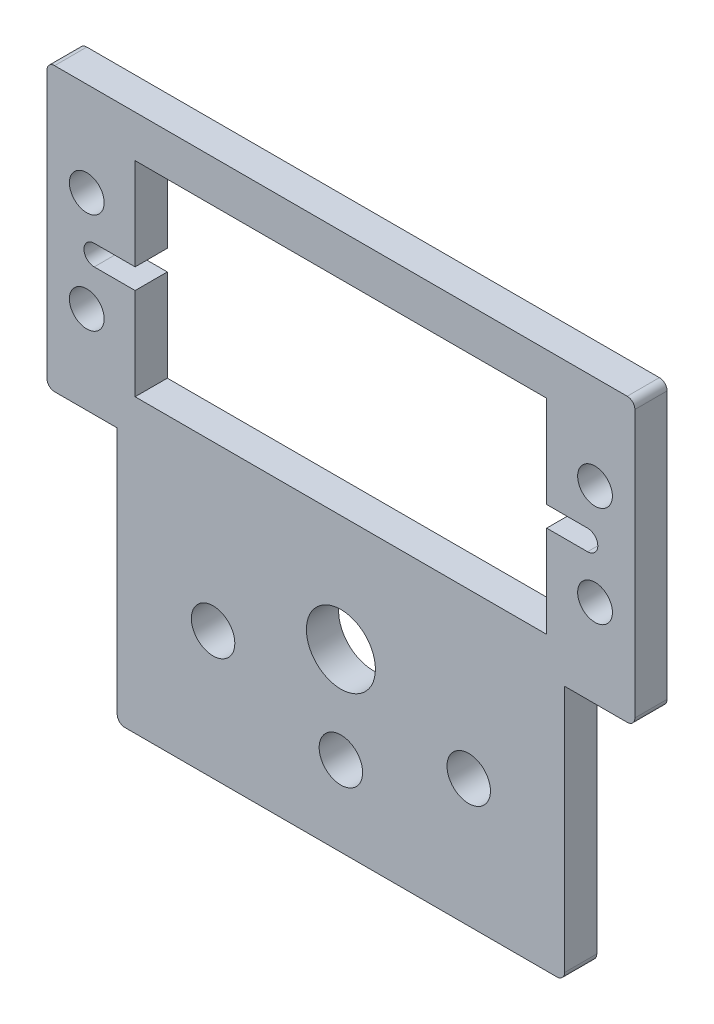
ISO-10303-21;
HEADER;
FILE_DESCRIPTION(('STEP AP214'),'2;1');
FILE_NAME('part.step','',(''),(''),'','','');
FILE_SCHEMA(('AUTOMOTIVE_DESIGN { 1 0 10303 214 1 1 1 1 }'));
ENDSEC;
DATA;
#1=APPLICATION_CONTEXT('core data for automotive mechanical design processes');
#2=APPLICATION_PROTOCOL_DEFINITION('international standard','automotive_design',2000,#1);
#3=PRODUCT_CONTEXT('',#1,'mechanical');
#4=PRODUCT('Part','Part','',(#3));
#5=PRODUCT_RELATED_PRODUCT_CATEGORY('part','',(#4));
#6=PRODUCT_DEFINITION_FORMATION('','',#4);
#7=PRODUCT_DEFINITION_CONTEXT('part definition',#1,'design');
#8=PRODUCT_DEFINITION('design','',#6,#7);
#9=PRODUCT_DEFINITION_SHAPE('','',#8);
#10=(LENGTH_UNIT() NAMED_UNIT(*) SI_UNIT(.MILLI.,.METRE.));
#11=(NAMED_UNIT(*) PLANE_ANGLE_UNIT() SI_UNIT($,.RADIAN.));
#12=(NAMED_UNIT(*) SI_UNIT($,.STERADIAN.) SOLID_ANGLE_UNIT());
#13=UNCERTAINTY_MEASURE_WITH_UNIT(LENGTH_MEASURE(1.E-05),#10,'distance_accuracy_value','');
#14=(GEOMETRIC_REPRESENTATION_CONTEXT(3) GLOBAL_UNCERTAINTY_ASSIGNED_CONTEXT((#13)) GLOBAL_UNIT_ASSIGNED_CONTEXT((#10,
#11,#12)) REPRESENTATION_CONTEXT('',''));
#15=CARTESIAN_POINT('',(0.,0.,0.));
#16=DIRECTION('',(0.,0.,1.));
#17=DIRECTION('',(1.,0.,0.));
#18=AXIS2_PLACEMENT_3D('',#15,#16,#17);
#19=CARTESIAN_POINT('',(1.778,49.2911153105269,3.2004));
#20=DIRECTION('',(1.,0.,0.));
#21=DIRECTION('',(0.,1.,0.));
#22=AXIS2_PLACEMENT_3D('',#19,#20,#21);
#23=PLANE('',#22);
#24=DIRECTION('',(0.,0.,1.));
#25=VECTOR('',#24,1.);
#26=CARTESIAN_POINT('',(1.77799999999999,40.1471153105269,-5.47132744404875));
#27=LINE('',#26,#25);
#28=CARTESIAN_POINT('',(1.77799999999999,40.1471153105269,0.));
#29=VERTEX_POINT('',#28);
#30=CARTESIAN_POINT('',(1.77799999999999,40.1471153105269,3.2004));
#31=VERTEX_POINT('',#30);
#32=EDGE_CURVE('E243',#29,#31,#27,.T.);
#33=ORIENTED_EDGE('',*,*,#32,.F.);
#34=DIRECTION('',(0.,-1.,0.));
#35=VECTOR('',#34,1.);
#36=CARTESIAN_POINT('',(1.778,49.2911153105269,0.));
#37=LINE('',#36,#35);
#38=CARTESIAN_POINT('',(1.778,49.2911153105269,0.));
#39=VERTEX_POINT('',#38);
#40=EDGE_CURVE('E230',#39,#29,#37,.T.);
#41=ORIENTED_EDGE('',*,*,#40,.F.);
#42=DIRECTION('',(0.,0.,-1.));
#43=VECTOR('',#42,1.);
#44=CARTESIAN_POINT('',(1.778,49.2911153105269,3.2004));
#45=LINE('',#44,#43);
#46=CARTESIAN_POINT('',(1.778,49.2911153105269,3.2004));
#47=VERTEX_POINT('',#46);
#48=EDGE_CURVE('E297',#47,#39,#45,.T.);
#49=ORIENTED_EDGE('',*,*,#48,.F.);
#50=DIRECTION('',(0.,-1.,0.));
#51=VECTOR('',#50,1.);
#52=CARTESIAN_POINT('',(1.778,49.2911153105269,3.2004));
#53=LINE('',#52,#51);
#54=EDGE_CURVE('E285',#47,#31,#53,.T.);
#55=ORIENTED_EDGE('',*,*,#54,.T.);
#56=EDGE_LOOP('',(#33,#41,#49,#55));
#57=FACE_BOUND('',#56,.T.);
#58=ADVANCED_FACE('F33',(#57),#23,.T.);
#59=CARTESIAN_POINT('',(42.672,49.2911153105269,3.2004));
#60=DIRECTION('',(-1.,0.,0.));
#61=DIRECTION('',(0.,-1.,0.));
#62=AXIS2_PLACEMENT_3D('',#59,#60,#61);
#63=PLANE('',#62);
#64=DIRECTION('',(0.,0.,1.));
#65=VECTOR('',#64,1.);
#66=CARTESIAN_POINT('',(42.672,38.1151153105269,-5.47132744404875));
#67=LINE('',#66,#65);
#68=CARTESIAN_POINT('',(42.672,38.1151153105269,0.));
#69=VERTEX_POINT('',#68);
#70=CARTESIAN_POINT('',(42.672,38.1151153105269,3.2004));
#71=VERTEX_POINT('',#70);
#72=EDGE_CURVE('E269',#69,#71,#67,.T.);
#73=ORIENTED_EDGE('',*,*,#72,.F.);
#74=DIRECTION('',(0.,1.,0.));
#75=VECTOR('',#74,1.);
#76=CARTESIAN_POINT('',(42.672,49.2911153105269,0.));
#77=LINE('',#76,#75);
#78=CARTESIAN_POINT('',(42.672,28.9711153105269,0.));
#79=VERTEX_POINT('',#78);
#80=EDGE_CURVE('E303',#79,#69,#77,.T.);
#81=ORIENTED_EDGE('',*,*,#80,.F.);
#82=DIRECTION('',(0.,0.,-1.));
#83=VECTOR('',#82,1.);
#84=CARTESIAN_POINT('',(42.672,28.9711153105269,3.2004));
#85=LINE('',#84,#83);
#86=CARTESIAN_POINT('',(42.672,28.9711153105269,3.2004));
#87=VERTEX_POINT('',#86);
#88=EDGE_CURVE('E313',#87,#79,#85,.T.);
#89=ORIENTED_EDGE('',*,*,#88,.F.);
#90=DIRECTION('',(0.,1.,0.));
#91=VECTOR('',#90,1.);
#92=CARTESIAN_POINT('',(42.672,49.2911153105269,3.2004));
#93=LINE('',#92,#91);
#94=EDGE_CURVE('E292',#87,#71,#93,.T.);
#95=ORIENTED_EDGE('',*,*,#94,.T.);
#96=EDGE_LOOP('',(#73,#81,#89,#95));
#97=FACE_BOUND('',#96,.T.);
#98=ADVANCED_FACE('F520',(#97),#63,.T.);
#99=CARTESIAN_POINT('',(0.,0.,3.2004));
#100=DIRECTION('',(0.,0.,-1.));
#101=DIRECTION('',(-1.,0.,0.));
#102=AXIS2_PLACEMENT_3D('',#99,#100,#101);
#103=PLANE('',#102);
#104=CARTESIAN_POINT('',(47.475,44.1311153105269,3.2004));
#105=DIRECTION('',(0.,0.,1.));
#106=DIRECTION('',(1.,0.,0.));
#107=AXIS2_PLACEMENT_3D('',#104,#105,#106);
#108=CIRCLE('',#107,1.72720000000001);
#109=CARTESIAN_POINT('',(49.2022,44.1311153105269,3.2004));
#110=VERTEX_POINT('',#109);
#111=EDGE_CURVE('E319',#110,#110,#108,.T.);
#112=ORIENTED_EDGE('',*,*,#111,.F.);
#113=EDGE_LOOP('',(#112));
#114=FACE_BOUND('',#113,.T.);
#115=CARTESIAN_POINT('',(-3.02500000000001,34.1311153105269,3.2004));
#116=DIRECTION('',(0.,0.,1.));
#117=DIRECTION('',(1.,0.,0.));
#118=AXIS2_PLACEMENT_3D('',#115,#116,#117);
#119=CIRCLE('',#118,1.7272);
#120=CARTESIAN_POINT('',(-1.2978,34.1311153105269,3.2004));
#121=VERTEX_POINT('',#120);
#122=EDGE_CURVE('E325',#121,#121,#119,.T.);
#123=ORIENTED_EDGE('',*,*,#122,.F.);
#124=EDGE_LOOP('',(#123));
#125=FACE_BOUND('',#124,.T.);
#126=CARTESIAN_POINT('',(-3.02500000000001,44.1311153105269,3.2004));
#127=DIRECTION('',(0.,0.,1.));
#128=DIRECTION('',(1.,0.,0.));
#129=AXIS2_PLACEMENT_3D('',#126,#127,#128);
#130=CIRCLE('',#129,1.72720000000001);
#131=CARTESIAN_POINT('',(-1.29780000000001,44.1311153105269,3.2004));
#132=VERTEX_POINT('',#131);
#133=EDGE_CURVE('E331',#132,#132,#130,.T.);
#134=ORIENTED_EDGE('',*,*,#133,.F.);
#135=EDGE_LOOP('',(#134));
#136=FACE_BOUND('',#135,.T.);
#137=CARTESIAN_POINT('',(47.475,34.1311153105269,3.2004));
#138=DIRECTION('',(0.,0.,1.));
#139=DIRECTION('',(1.,0.,0.));
#140=AXIS2_PLACEMENT_3D('',#137,#138,#139);
#141=CIRCLE('',#140,1.72720000000001);
#142=CARTESIAN_POINT('',(49.2022,34.1311153105269,3.2004));
#143=VERTEX_POINT('',#142);
#144=EDGE_CURVE('E337',#143,#143,#141,.T.);
#145=ORIENTED_EDGE('',*,*,#144,.F.);
#146=EDGE_LOOP('',(#145));
#147=FACE_BOUND('',#146,.T.);
#148=CARTESIAN_POINT('',(34.925,12.7,3.2004));
#149=DIRECTION('',(0.,0.,1.));
#150=DIRECTION('',(1.,0.,0.));
#151=AXIS2_PLACEMENT_3D('',#148,#149,#150);
#152=CIRCLE('',#151,2.159);
#153=CARTESIAN_POINT('',(37.084,12.7,3.2004));
#154=VERTEX_POINT('',#153);
#155=EDGE_CURVE('E343',#154,#154,#152,.T.);
#156=ORIENTED_EDGE('',*,*,#155,.F.);
#157=EDGE_LOOP('',(#156));
#158=FACE_BOUND('',#157,.T.);
#159=CARTESIAN_POINT('',(9.52499999999998,12.7,3.2004));
#160=DIRECTION('',(0.,0.,1.));
#161=DIRECTION('',(1.,0.,0.));
#162=AXIS2_PLACEMENT_3D('',#159,#160,#161);
#163=CIRCLE('',#162,2.159);
#164=CARTESIAN_POINT('',(11.684,12.7,3.2004));
#165=VERTEX_POINT('',#164);
#166=EDGE_CURVE('E349',#165,#165,#163,.T.);
#167=ORIENTED_EDGE('',*,*,#166,.F.);
#168=EDGE_LOOP('',(#167));
#169=FACE_BOUND('',#168,.T.);
#170=DIRECTION('',(1.,0.,0.));
#171=VECTOR('',#170,1.);
#172=CARTESIAN_POINT('',(0.,0.,3.2004));
#173=LINE('',#172,#171);
#174=CARTESIAN_POINT('',(0.762,0.,3.2004));
#175=VERTEX_POINT('',#174);
#176=CARTESIAN_POINT('',(43.688,0.,3.2004));
#177=VERTEX_POINT('',#176);
#178=EDGE_CURVE('E367',#175,#177,#173,.T.);
#179=ORIENTED_EDGE('',*,*,#178,.T.);
#180=CARTESIAN_POINT('',(43.688,0.762000000000003,3.2004));
#181=DIRECTION('',(0.,0.,-1.));
#182=DIRECTION('',(-1.,0.,0.));
#183=AXIS2_PLACEMENT_3D('',#180,#181,#182);
#184=CIRCLE('',#183,0.762);
#185=CARTESIAN_POINT('',(44.45,0.762000000000004,3.2004));
#186=VERTEX_POINT('',#185);
#187=EDGE_CURVE('E430',#177,#186,#184,.F.);
#188=ORIENTED_EDGE('',*,*,#187,.T.);
#189=DIRECTION('',(0.,1.,0.));
#190=VECTOR('',#189,1.);
#191=CARTESIAN_POINT('',(44.45,0.,3.2004));
#192=LINE('',#191,#190);
#193=CARTESIAN_POINT('',(44.4499999999999,25.4,3.2004));
#194=VERTEX_POINT('',#193);
#195=EDGE_CURVE('E370',#186,#194,#192,.T.);
#196=ORIENTED_EDGE('',*,*,#195,.T.);
#197=DIRECTION('',(1.,0.,0.));
#198=VECTOR('',#197,1.);
#199=CARTESIAN_POINT('',(44.4499999999999,25.4,3.2004));
#200=LINE('',#199,#198);
#201=CARTESIAN_POINT('',(50.673,25.4,3.2004));
#202=VERTEX_POINT('',#201);
#203=EDGE_CURVE('E372',#194,#202,#200,.T.);
#204=ORIENTED_EDGE('',*,*,#203,.T.);
#205=CARTESIAN_POINT('',(50.673,26.162,3.2004));
#206=DIRECTION('',(0.,0.,-1.));
#207=DIRECTION('',(-1.,0.,0.));
#208=AXIS2_PLACEMENT_3D('',#205,#206,#207);
#209=CIRCLE('',#208,0.762);
#210=CARTESIAN_POINT('',(51.435,26.162,3.2004));
#211=VERTEX_POINT('',#210);
#212=EDGE_CURVE('E55',#202,#211,#209,.F.);
#213=ORIENTED_EDGE('',*,*,#212,.T.);
#214=DIRECTION('',(0.,1.,0.));
#215=VECTOR('',#214,1.);
#216=CARTESIAN_POINT('',(51.4349999999999,53.4646590224651,3.2004));
#217=LINE('',#216,#215);
#218=CARTESIAN_POINT('',(51.4349999999999,52.7026590224651,3.2004));
#219=VERTEX_POINT('',#218);
#220=EDGE_CURVE('E374',#211,#219,#217,.T.);
#221=ORIENTED_EDGE('',*,*,#220,.T.);
#222=CARTESIAN_POINT('',(50.6729999999999,52.7026590224651,3.2004));
#223=DIRECTION('',(0.,0.,-1.));
#224=DIRECTION('',(-1.,0.,0.));
#225=AXIS2_PLACEMENT_3D('',#222,#223,#224);
#226=CIRCLE('',#225,0.762);
#227=CARTESIAN_POINT('',(50.6729999999999,53.4646590224651,3.2004));
#228=VERTEX_POINT('',#227);
#229=EDGE_CURVE('E427',#219,#228,#226,.F.);
#230=ORIENTED_EDGE('',*,*,#229,.T.);
#231=DIRECTION('',(-1.,0.,0.));
#232=VECTOR('',#231,1.);
#233=CARTESIAN_POINT('',(-6.98500000000005,53.464659022465,3.2004));
#234=LINE('',#233,#232);
#235=CARTESIAN_POINT('',(-6.22300000000006,53.464659022465,3.2004));
#236=VERTEX_POINT('',#235);
#237=EDGE_CURVE('E355',#228,#236,#234,.T.);
#238=ORIENTED_EDGE('',*,*,#237,.T.);
#239=CARTESIAN_POINT('',(-6.22300000000005,52.702659022465,3.2004));
#240=DIRECTION('',(0.,0.,-1.));
#241=DIRECTION('',(-1.,0.,0.));
#242=AXIS2_PLACEMENT_3D('',#239,#240,#241);
#243=CIRCLE('',#242,0.762);
#244=CARTESIAN_POINT('',(-6.98500000000005,52.702659022465,3.2004));
#245=VERTEX_POINT('',#244);
#246=EDGE_CURVE('E421',#236,#245,#243,.F.);
#247=ORIENTED_EDGE('',*,*,#246,.T.);
#248=DIRECTION('',(0.,-1.,0.));
#249=VECTOR('',#248,1.);
#250=CARTESIAN_POINT('',(-6.98500000000006,25.4,3.2004));
#251=LINE('',#250,#249);
#252=CARTESIAN_POINT('',(-6.98500000000006,26.162,3.2004));
#253=VERTEX_POINT('',#252);
#254=EDGE_CURVE('E358',#245,#253,#251,.T.);
#255=ORIENTED_EDGE('',*,*,#254,.T.);
#256=CARTESIAN_POINT('',(-6.22300000000006,26.162,3.2004));
#257=DIRECTION('',(0.,0.,-1.));
#258=DIRECTION('',(-1.,0.,0.));
#259=AXIS2_PLACEMENT_3D('',#256,#257,#258);
#260=CIRCLE('',#259,0.762);
#261=CARTESIAN_POINT('',(-6.22300000000006,25.4,3.2004));
#262=VERTEX_POINT('',#261);
#263=EDGE_CURVE('E423',#253,#262,#260,.F.);
#264=ORIENTED_EDGE('',*,*,#263,.T.);
#265=DIRECTION('',(1.,0.,0.));
#266=VECTOR('',#265,1.);
#267=CARTESIAN_POINT('',(0.,25.4,3.2004));
#268=LINE('',#267,#266);
#269=CARTESIAN_POINT('',(0.,25.4,3.2004));
#270=VERTEX_POINT('',#269);
#271=EDGE_CURVE('E362',#262,#270,#268,.T.);
#272=ORIENTED_EDGE('',*,*,#271,.T.);
#273=DIRECTION('',(0.,-1.,0.));
#274=VECTOR('',#273,1.);
#275=CARTESIAN_POINT('',(0.,0.,3.2004));
#276=LINE('',#275,#274);
#277=CARTESIAN_POINT('',(0.,0.762,3.2004));
#278=VERTEX_POINT('',#277);
#279=EDGE_CURVE('E364',#270,#278,#276,.T.);
#280=ORIENTED_EDGE('',*,*,#279,.T.);
#281=CARTESIAN_POINT('',(0.762,0.762,3.2004));
#282=DIRECTION('',(0.,0.,-1.));
#283=DIRECTION('',(-1.,0.,0.));
#284=AXIS2_PLACEMENT_3D('',#281,#282,#283);
#285=CIRCLE('',#284,0.762);
#286=EDGE_CURVE('E425',#278,#175,#285,.F.);
#287=ORIENTED_EDGE('',*,*,#286,.T.);
#288=EDGE_LOOP('',(#179,#188,#196,#204,#213,#221,#230,#238,#247,#255,#264,#272,#280,#287));
#289=FACE_BOUND('',#288,.T.);
#290=CARTESIAN_POINT('',(-2.28600000000005,39.1311153105269,3.2004));
#291=DIRECTION('',(0.,0.,1.));
#292=DIRECTION('',(1.,0.,0.));
#293=AXIS2_PLACEMENT_3D('',#290,#291,#292);
#294=CIRCLE('',#293,1.01600000000003);
#295=CARTESIAN_POINT('',(-2.28600000000001,40.1471153105269,3.2004));
#296=VERTEX_POINT('',#295);
#297=CARTESIAN_POINT('',(-2.286,38.1151153105269,3.2004));
#298=VERTEX_POINT('',#297);
#299=EDGE_CURVE('E233',#296,#298,#294,.T.);
#300=ORIENTED_EDGE('',*,*,#299,.F.);
#301=DIRECTION('',(-1.,0.,0.));
#302=VECTOR('',#301,1.);
#303=CARTESIAN_POINT('',(-2.28600000000001,40.1471153105269,3.2004));
#304=LINE('',#303,#302);
#305=EDGE_CURVE('E223',#31,#296,#304,.T.);
#306=ORIENTED_EDGE('',*,*,#305,.F.);
#307=ORIENTED_EDGE('',*,*,#54,.F.);
#308=DIRECTION('',(-1.,0.,0.));
#309=VECTOR('',#308,1.);
#310=CARTESIAN_POINT('',(1.778,49.2911153105269,3.2004));
#311=LINE('',#310,#309);
#312=CARTESIAN_POINT('',(42.672,49.2911153105269,3.2004));
#313=VERTEX_POINT('',#312);
#314=EDGE_CURVE('E295',#313,#47,#311,.T.);
#315=ORIENTED_EDGE('',*,*,#314,.F.);
#316=CARTESIAN_POINT('',(42.672,40.1471153105269,3.2004));
#317=VERTEX_POINT('',#316);
#318=EDGE_CURVE('E291',#317,#313,#93,.T.);
#319=ORIENTED_EDGE('',*,*,#318,.F.);
#320=DIRECTION('',(-1.,0.,0.));
#321=VECTOR('',#320,1.);
#322=CARTESIAN_POINT('',(42.672,40.1471153105269,3.2004));
#323=LINE('',#322,#321);
#324=CARTESIAN_POINT('',(46.736,40.1471153105269,3.2004));
#325=VERTEX_POINT('',#324);
#326=EDGE_CURVE('E247',#325,#317,#323,.T.);
#327=ORIENTED_EDGE('',*,*,#326,.F.);
#328=CARTESIAN_POINT('',(46.736,39.1311153105269,3.2004));
#329=DIRECTION('',(0.,0.,1.));
#330=DIRECTION('',(-1.,0.,0.));
#331=AXIS2_PLACEMENT_3D('',#328,#329,#330);
#332=CIRCLE('',#331,1.016);
#333=CARTESIAN_POINT('',(46.736,38.1151153105269,3.2004));
#334=VERTEX_POINT('',#333);
#335=EDGE_CURVE('E250',#334,#325,#332,.T.);
#336=ORIENTED_EDGE('',*,*,#335,.F.);
#337=DIRECTION('',(1.,0.,0.));
#338=VECTOR('',#337,1.);
#339=CARTESIAN_POINT('',(42.672,38.1151153105269,3.2004));
#340=LINE('',#339,#338);
#341=EDGE_CURVE('E253',#71,#334,#340,.T.);
#342=ORIENTED_EDGE('',*,*,#341,.F.);
#343=ORIENTED_EDGE('',*,*,#94,.F.);
#344=DIRECTION('',(1.,0.,0.));
#345=VECTOR('',#344,1.);
#346=CARTESIAN_POINT('',(1.77799999999996,28.9711153105269,3.2004));
#347=LINE('',#346,#345);
#348=CARTESIAN_POINT('',(1.77799999999996,28.9711153105269,3.2004));
#349=VERTEX_POINT('',#348);
#350=EDGE_CURVE('E288',#349,#87,#347,.T.);
#351=ORIENTED_EDGE('',*,*,#350,.F.);
#352=CARTESIAN_POINT('',(1.77799999999998,38.1151153105269,3.2004));
#353=VERTEX_POINT('',#352);
#354=EDGE_CURVE('E289',#353,#349,#53,.T.);
#355=ORIENTED_EDGE('',*,*,#354,.F.);
#356=DIRECTION('',(1.,0.,0.));
#357=VECTOR('',#356,1.);
#358=CARTESIAN_POINT('',(-2.286,38.1151153105269,3.2004));
#359=LINE('',#358,#357);
#360=EDGE_CURVE('E231',#298,#353,#359,.T.);
#361=ORIENTED_EDGE('',*,*,#360,.F.);
#362=EDGE_LOOP('',(#300,#306,#307,#315,#319,#327,#336,#342,#343,#351,#355,#361));
#363=FACE_BOUND('',#362,.T.);
#364=CARTESIAN_POINT('',(22.225,17.4625,3.2004));
#365=DIRECTION('',(0.,0.,1.));
#366=DIRECTION('',(1.,0.,0.));
#367=AXIS2_PLACEMENT_3D('',#364,#365,#366);
#368=CIRCLE('',#367,3.429);
#369=CARTESIAN_POINT('',(25.654,17.4625,3.2004));
#370=VERTEX_POINT('',#369);
#371=EDGE_CURVE('E279',#370,#370,#368,.T.);
#372=ORIENTED_EDGE('',*,*,#371,.F.);
#373=EDGE_LOOP('',(#372));
#374=FACE_BOUND('',#373,.T.);
#375=CARTESIAN_POINT('',(22.225,7.93750000000001,3.2004));
#376=DIRECTION('',(0.,0.,1.));
#377=DIRECTION('',(1.,0.,0.));
#378=AXIS2_PLACEMENT_3D('',#375,#376,#377);
#379=CIRCLE('',#378,2.159);
#380=CARTESIAN_POINT('',(24.384,7.93750000000001,3.2004));
#381=VERTEX_POINT('',#380);
#382=EDGE_CURVE('E273',#381,#381,#379,.T.);
#383=ORIENTED_EDGE('',*,*,#382,.F.);
#384=EDGE_LOOP('',(#383));
#385=FACE_BOUND('',#384,.T.);
#386=ADVANCED_FACE('F471',(#114,#125,#136,#147,#158,#169,#289,#363,#374,#385),#103,.F.);
#387=CARTESIAN_POINT('',(0.,0.,0.));
#388=DIRECTION('',(0.,0.,-1.));
#389=DIRECTION('',(-1.,0.,0.));
#390=AXIS2_PLACEMENT_3D('',#387,#388,#389);
#391=PLANE('',#390);
#392=DIRECTION('',(-1.,0.,0.));
#393=VECTOR('',#392,1.);
#394=CARTESIAN_POINT('',(-2.28600000000001,40.1471153105269,0.));
#395=LINE('',#394,#393);
#396=CARTESIAN_POINT('',(-2.28600000000001,40.1471153105269,0.));
#397=VERTEX_POINT('',#396);
#398=EDGE_CURVE('E220',#29,#397,#395,.T.);
#399=ORIENTED_EDGE('',*,*,#398,.T.);
#400=CARTESIAN_POINT('',(-2.28600000000005,39.1311153105269,0.));
#401=DIRECTION('',(0.,0.,-1.));
#402=DIRECTION('',(-1.,0.,0.));
#403=AXIS2_PLACEMENT_3D('',#400,#401,#402);
#404=CIRCLE('',#403,1.01600000000003);
#405=CARTESIAN_POINT('',(-2.286,38.1151153105269,0.));
#406=VERTEX_POINT('',#405);
#407=EDGE_CURVE('E207',#397,#406,#404,.F.);
#408=ORIENTED_EDGE('',*,*,#407,.T.);
#409=DIRECTION('',(1.,0.,0.));
#410=VECTOR('',#409,1.);
#411=CARTESIAN_POINT('',(-2.286,38.1151153105269,0.));
#412=LINE('',#411,#410);
#413=CARTESIAN_POINT('',(1.778,38.1151153105269,0.));
#414=VERTEX_POINT('',#413);
#415=EDGE_CURVE('E238',#406,#414,#412,.T.);
#416=ORIENTED_EDGE('',*,*,#415,.T.);
#417=CARTESIAN_POINT('',(1.77799999999996,28.9711153105269,0.));
#418=VERTEX_POINT('',#417);
#419=EDGE_CURVE('E282',#414,#418,#37,.T.);
#420=ORIENTED_EDGE('',*,*,#419,.T.);
#421=DIRECTION('',(1.,0.,0.));
#422=VECTOR('',#421,1.);
#423=CARTESIAN_POINT('',(1.77799999999996,28.9711153105269,0.));
#424=LINE('',#423,#422);
#425=EDGE_CURVE('E299',#418,#79,#424,.T.);
#426=ORIENTED_EDGE('',*,*,#425,.T.);
#427=ORIENTED_EDGE('',*,*,#80,.T.);
#428=DIRECTION('',(1.,0.,0.));
#429=VECTOR('',#428,1.);
#430=CARTESIAN_POINT('',(42.672,38.1151153105269,0.));
#431=LINE('',#430,#429);
#432=CARTESIAN_POINT('',(46.736,38.1151153105269,0.));
#433=VERTEX_POINT('',#432);
#434=EDGE_CURVE('E249',#69,#433,#431,.T.);
#435=ORIENTED_EDGE('',*,*,#434,.T.);
#436=CARTESIAN_POINT('',(46.736,39.1311153105269,0.));
#437=DIRECTION('',(0.,0.,-1.));
#438=DIRECTION('',(-1.,0.,0.));
#439=AXIS2_PLACEMENT_3D('',#436,#437,#438);
#440=CIRCLE('',#439,1.016);
#441=CARTESIAN_POINT('',(46.736,40.1471153105269,0.));
#442=VERTEX_POINT('',#441);
#443=EDGE_CURVE('E264',#433,#442,#440,.F.);
#444=ORIENTED_EDGE('',*,*,#443,.T.);
#445=DIRECTION('',(-1.,0.,0.));
#446=VECTOR('',#445,1.);
#447=CARTESIAN_POINT('',(42.672,40.1471153105269,0.));
#448=LINE('',#447,#446);
#449=CARTESIAN_POINT('',(42.672,40.1471153105269,0.));
#450=VERTEX_POINT('',#449);
#451=EDGE_CURVE('E259',#442,#450,#448,.T.);
#452=ORIENTED_EDGE('',*,*,#451,.T.);
#453=CARTESIAN_POINT('',(42.672,49.2911153105269,0.));
#454=VERTEX_POINT('',#453);
#455=EDGE_CURVE('E302',#450,#454,#77,.T.);
#456=ORIENTED_EDGE('',*,*,#455,.T.);
#457=DIRECTION('',(-1.,0.,0.));
#458=VECTOR('',#457,1.);
#459=CARTESIAN_POINT('',(1.778,49.2911153105269,0.));
#460=LINE('',#459,#458);
#461=EDGE_CURVE('E306',#454,#39,#460,.T.);
#462=ORIENTED_EDGE('',*,*,#461,.T.);
#463=ORIENTED_EDGE('',*,*,#40,.T.);
#464=EDGE_LOOP('',(#399,#408,#416,#420,#426,#427,#435,#444,#452,#456,#462,#463));
#465=FACE_BOUND('',#464,.T.);
#466=CARTESIAN_POINT('',(22.225,17.4625,0.));
#467=DIRECTION('',(0.,0.,1.));
#468=DIRECTION('',(1.,0.,0.));
#469=AXIS2_PLACEMENT_3D('',#466,#467,#468);
#470=CIRCLE('',#469,3.429);
#471=CARTESIAN_POINT('',(25.654,17.4625,0.));
#472=VERTEX_POINT('',#471);
#473=EDGE_CURVE('E276',#472,#472,#470,.T.);
#474=ORIENTED_EDGE('',*,*,#473,.T.);
#475=EDGE_LOOP('',(#474));
#476=FACE_BOUND('',#475,.T.);
#477=CARTESIAN_POINT('',(-3.02500000000001,34.1311153105269,0.));
#478=DIRECTION('',(0.,0.,1.));
#479=DIRECTION('',(1.,0.,0.));
#480=AXIS2_PLACEMENT_3D('',#477,#478,#479);
#481=CIRCLE('',#480,1.7272);
#482=CARTESIAN_POINT('',(-1.2978,34.1311153105269,0.));
#483=VERTEX_POINT('',#482);
#484=EDGE_CURVE('E322',#483,#483,#481,.T.);
#485=ORIENTED_EDGE('',*,*,#484,.T.);
#486=EDGE_LOOP('',(#485));
#487=FACE_BOUND('',#486,.T.);
#488=CARTESIAN_POINT('',(47.475,34.1311153105269,0.));
#489=DIRECTION('',(0.,0.,1.));
#490=DIRECTION('',(1.,0.,0.));
#491=AXIS2_PLACEMENT_3D('',#488,#489,#490);
#492=CIRCLE('',#491,1.72720000000001);
#493=CARTESIAN_POINT('',(49.2022,34.1311153105269,0.));
#494=VERTEX_POINT('',#493);
#495=EDGE_CURVE('E334',#494,#494,#492,.T.);
#496=ORIENTED_EDGE('',*,*,#495,.T.);
#497=EDGE_LOOP('',(#496));
#498=FACE_BOUND('',#497,.T.);
#499=CARTESIAN_POINT('',(9.52499999999998,12.7,0.));
#500=DIRECTION('',(0.,0.,1.));
#501=DIRECTION('',(1.,0.,0.));
#502=AXIS2_PLACEMENT_3D('',#499,#500,#501);
#503=CIRCLE('',#502,2.159);
#504=CARTESIAN_POINT('',(11.684,12.7,0.));
#505=VERTEX_POINT('',#504);
#506=EDGE_CURVE('E346',#505,#505,#503,.T.);
#507=ORIENTED_EDGE('',*,*,#506,.T.);
#508=EDGE_LOOP('',(#507));
#509=FACE_BOUND('',#508,.T.);
#510=DIRECTION('',(0.,1.,0.));
#511=VECTOR('',#510,1.);
#512=CARTESIAN_POINT('',(44.45,0.,0.));
#513=LINE('',#512,#511);
#514=CARTESIAN_POINT('',(44.45,0.762000000000004,0.));
#515=VERTEX_POINT('',#514);
#516=CARTESIAN_POINT('',(44.4499999999999,25.4,0.));
#517=VERTEX_POINT('',#516);
#518=EDGE_CURVE('E390',#515,#517,#513,.T.);
#519=ORIENTED_EDGE('',*,*,#518,.F.);
#520=CARTESIAN_POINT('',(43.688,0.762000000000003,0.));
#521=DIRECTION('',(0.,0.,-1.));
#522=DIRECTION('',(-1.,0.,0.));
#523=AXIS2_PLACEMENT_3D('',#520,#521,#522);
#524=CIRCLE('',#523,0.762);
#525=CARTESIAN_POINT('',(43.688,0.,0.));
#526=VERTEX_POINT('',#525);
#527=EDGE_CURVE('E414',#515,#526,#524,.T.);
#528=ORIENTED_EDGE('',*,*,#527,.T.);
#529=DIRECTION('',(1.,0.,0.));
#530=VECTOR('',#529,1.);
#531=CARTESIAN_POINT('',(0.,0.,0.));
#532=LINE('',#531,#530);
#533=CARTESIAN_POINT('',(0.762,0.,0.));
#534=VERTEX_POINT('',#533);
#535=EDGE_CURVE('E387',#534,#526,#532,.T.);
#536=ORIENTED_EDGE('',*,*,#535,.F.);
#537=CARTESIAN_POINT('',(0.762,0.762,0.));
#538=DIRECTION('',(0.,0.,-1.));
#539=DIRECTION('',(-1.,0.,0.));
#540=AXIS2_PLACEMENT_3D('',#537,#538,#539);
#541=CIRCLE('',#540,0.762);
#542=CARTESIAN_POINT('',(0.,0.762,0.));
#543=VERTEX_POINT('',#542);
#544=EDGE_CURVE('E408',#534,#543,#541,.T.);
#545=ORIENTED_EDGE('',*,*,#544,.T.);
#546=DIRECTION('',(0.,-1.,0.));
#547=VECTOR('',#546,1.);
#548=CARTESIAN_POINT('',(0.,0.,0.));
#549=LINE('',#548,#547);
#550=CARTESIAN_POINT('',(0.,25.4,0.));
#551=VERTEX_POINT('',#550);
#552=EDGE_CURVE('E384',#551,#543,#549,.T.);
#553=ORIENTED_EDGE('',*,*,#552,.F.);
#554=DIRECTION('',(1.,0.,0.));
#555=VECTOR('',#554,1.);
#556=CARTESIAN_POINT('',(0.,25.4,0.));
#557=LINE('',#556,#555);
#558=CARTESIAN_POINT('',(-6.22300000000006,25.4,0.));
#559=VERTEX_POINT('',#558);
#560=EDGE_CURVE('E382',#559,#551,#557,.T.);
#561=ORIENTED_EDGE('',*,*,#560,.F.);
#562=CARTESIAN_POINT('',(-6.22300000000006,26.162,0.));
#563=DIRECTION('',(0.,0.,-1.));
#564=DIRECTION('',(-1.,0.,0.));
#565=AXIS2_PLACEMENT_3D('',#562,#563,#564);
#566=CIRCLE('',#565,0.762);
#567=CARTESIAN_POINT('',(-6.98500000000006,26.162,0.));
#568=VERTEX_POINT('',#567);
#569=EDGE_CURVE('E406',#559,#568,#566,.T.);
#570=ORIENTED_EDGE('',*,*,#569,.T.);
#571=DIRECTION('',(0.,-1.,0.));
#572=VECTOR('',#571,1.);
#573=CARTESIAN_POINT('',(-6.98500000000006,25.4,0.));
#574=LINE('',#573,#572);
#575=CARTESIAN_POINT('',(-6.98500000000005,52.702659022465,0.));
#576=VERTEX_POINT('',#575);
#577=EDGE_CURVE('E379',#576,#568,#574,.T.);
#578=ORIENTED_EDGE('',*,*,#577,.F.);
#579=CARTESIAN_POINT('',(-6.22300000000005,52.702659022465,0.));
#580=DIRECTION('',(0.,0.,-1.));
#581=DIRECTION('',(-1.,0.,0.));
#582=AXIS2_PLACEMENT_3D('',#579,#580,#581);
#583=CIRCLE('',#582,0.762);
#584=CARTESIAN_POINT('',(-6.22300000000006,53.464659022465,0.));
#585=VERTEX_POINT('',#584);
#586=EDGE_CURVE('E404',#576,#585,#583,.T.);
#587=ORIENTED_EDGE('',*,*,#586,.T.);
#588=DIRECTION('',(-1.,0.,0.));
#589=VECTOR('',#588,1.);
#590=CARTESIAN_POINT('',(-6.98500000000005,53.464659022465,0.));
#591=LINE('',#590,#589);
#592=CARTESIAN_POINT('',(50.6729999999999,53.4646590224651,0.));
#593=VERTEX_POINT('',#592);
#594=EDGE_CURVE('E352',#593,#585,#591,.T.);
#595=ORIENTED_EDGE('',*,*,#594,.F.);
#596=CARTESIAN_POINT('',(50.6729999999999,52.7026590224651,0.));
#597=DIRECTION('',(0.,0.,-1.));
#598=DIRECTION('',(-1.,0.,0.));
#599=AXIS2_PLACEMENT_3D('',#596,#597,#598);
#600=CIRCLE('',#599,0.762);
#601=CARTESIAN_POINT('',(51.4349999999999,52.7026590224651,0.));
#602=VERTEX_POINT('',#601);
#603=EDGE_CURVE('E410',#593,#602,#600,.T.);
#604=ORIENTED_EDGE('',*,*,#603,.T.);
#605=DIRECTION('',(0.,1.,0.));
#606=VECTOR('',#605,1.);
#607=CARTESIAN_POINT('',(51.4349999999999,53.4646590224651,0.));
#608=LINE('',#607,#606);
#609=CARTESIAN_POINT('',(51.435,26.162,0.));
#610=VERTEX_POINT('',#609);
#611=EDGE_CURVE('E359',#610,#602,#608,.T.);
#612=ORIENTED_EDGE('',*,*,#611,.F.);
#613=CARTESIAN_POINT('',(50.673,26.162,0.));
#614=DIRECTION('',(0.,0.,-1.));
#615=DIRECTION('',(-1.,0.,0.));
#616=AXIS2_PLACEMENT_3D('',#613,#614,#615);
#617=CIRCLE('',#616,0.762);
#618=CARTESIAN_POINT('',(50.673,25.4,0.));
#619=VERTEX_POINT('',#618);
#620=EDGE_CURVE('E412',#610,#619,#617,.T.);
#621=ORIENTED_EDGE('',*,*,#620,.T.);
#622=DIRECTION('',(1.,0.,0.));
#623=VECTOR('',#622,1.);
#624=CARTESIAN_POINT('',(44.4499999999999,25.4,0.));
#625=LINE('',#624,#623);
#626=EDGE_CURVE('E392',#517,#619,#625,.T.);
#627=ORIENTED_EDGE('',*,*,#626,.F.);
#628=EDGE_LOOP('',(#519,#528,#536,#545,#553,#561,#570,#578,#587,#595,#604,#612,#621,#627));
#629=FACE_BOUND('',#628,.T.);
#630=CARTESIAN_POINT('',(34.925,12.7,0.));
#631=DIRECTION('',(0.,0.,1.));
#632=DIRECTION('',(1.,0.,0.));
#633=AXIS2_PLACEMENT_3D('',#630,#631,#632);
#634=CIRCLE('',#633,2.159);
#635=CARTESIAN_POINT('',(37.084,12.7,0.));
#636=VERTEX_POINT('',#635);
#637=EDGE_CURVE('E340',#636,#636,#634,.T.);
#638=ORIENTED_EDGE('',*,*,#637,.T.);
#639=EDGE_LOOP('',(#638));
#640=FACE_BOUND('',#639,.T.);
#641=CARTESIAN_POINT('',(-3.02500000000001,44.1311153105269,0.));
#642=DIRECTION('',(0.,0.,1.));
#643=DIRECTION('',(1.,0.,0.));
#644=AXIS2_PLACEMENT_3D('',#641,#642,#643);
#645=CIRCLE('',#644,1.72720000000001);
#646=CARTESIAN_POINT('',(-1.29780000000001,44.1311153105269,0.));
#647=VERTEX_POINT('',#646);
#648=EDGE_CURVE('E328',#647,#647,#645,.T.);
#649=ORIENTED_EDGE('',*,*,#648,.T.);
#650=EDGE_LOOP('',(#649));
#651=FACE_BOUND('',#650,.T.);
#652=CARTESIAN_POINT('',(47.475,44.1311153105269,0.));
#653=DIRECTION('',(0.,0.,1.));
#654=DIRECTION('',(1.,0.,0.));
#655=AXIS2_PLACEMENT_3D('',#652,#653,#654);
#656=CIRCLE('',#655,1.72720000000001);
#657=CARTESIAN_POINT('',(49.2022,44.1311153105269,0.));
#658=VERTEX_POINT('',#657);
#659=EDGE_CURVE('E318',#658,#658,#656,.T.);
#660=ORIENTED_EDGE('',*,*,#659,.T.);
#661=EDGE_LOOP('',(#660));
#662=FACE_BOUND('',#661,.T.);
#663=CARTESIAN_POINT('',(22.225,7.93750000000001,0.));
#664=DIRECTION('',(0.,0.,1.));
#665=DIRECTION('',(1.,0.,0.));
#666=AXIS2_PLACEMENT_3D('',#663,#664,#665);
#667=CIRCLE('',#666,2.159);
#668=CARTESIAN_POINT('',(24.384,7.93750000000001,0.));
#669=VERTEX_POINT('',#668);
#670=EDGE_CURVE('E246',#669,#669,#667,.T.);
#671=ORIENTED_EDGE('',*,*,#670,.T.);
#672=EDGE_LOOP('',(#671));
#673=FACE_BOUND('',#672,.T.);
#674=ADVANCED_FACE('F227',(#465,#476,#487,#498,#509,#629,#640,#651,#662,#673),#391,.T.);
#675=CARTESIAN_POINT('',(-6.98500000000005,53.464659022465,3.2004));
#676=DIRECTION('',(0.,-1.,0.));
#677=DIRECTION('',(1.,0.,0.));
#678=AXIS2_PLACEMENT_3D('',#675,#676,#677);
#679=PLANE('',#678);
#680=ORIENTED_EDGE('',*,*,#237,.F.);
#681=DIRECTION('',(0.,0.,-1.));
#682=VECTOR('',#681,1.);
#683=CARTESIAN_POINT('',(50.6729999999999,53.4646590224651,3.2004));
#684=LINE('',#683,#682);
#685=EDGE_CURVE('E440',#228,#593,#684,.T.);
#686=ORIENTED_EDGE('',*,*,#685,.T.);
#687=ORIENTED_EDGE('',*,*,#594,.T.);
#688=DIRECTION('',(0.,0.,-1.));
#689=VECTOR('',#688,1.);
#690=CARTESIAN_POINT('',(-6.22300000000006,53.464659022465,3.2004));
#691=LINE('',#690,#689);
#692=EDGE_CURVE('E438',#585,#236,#691,.F.);
#693=ORIENTED_EDGE('',*,*,#692,.T.);
#694=EDGE_LOOP('',(#680,#686,#687,#693));
#695=FACE_BOUND('',#694,.T.);
#696=ADVANCED_FACE('F477',(#695),#679,.F.);
#697=CARTESIAN_POINT('',(-6.98500000000006,25.4,3.2004));
#698=DIRECTION('',(1.,0.,0.));
#699=DIRECTION('',(0.,1.,0.));
#700=AXIS2_PLACEMENT_3D('',#697,#698,#699);
#701=PLANE('',#700);
#702=ORIENTED_EDGE('',*,*,#577,.T.);
#703=DIRECTION('',(0.,0.,-1.));
#704=VECTOR('',#703,1.);
#705=CARTESIAN_POINT('',(-6.98500000000006,26.162,3.2004));
#706=LINE('',#705,#704);
#707=EDGE_CURVE('E11',#568,#253,#706,.F.);
#708=ORIENTED_EDGE('',*,*,#707,.T.);
#709=ORIENTED_EDGE('',*,*,#254,.F.);
#710=DIRECTION('',(0.,0.,-1.));
#711=VECTOR('',#710,1.);
#712=CARTESIAN_POINT('',(-6.98500000000005,52.702659022465,3.2004));
#713=LINE('',#712,#711);
#714=EDGE_CURVE('E41',#245,#576,#713,.T.);
#715=ORIENTED_EDGE('',*,*,#714,.T.);
#716=EDGE_LOOP('',(#702,#708,#709,#715));
#717=FACE_BOUND('',#716,.T.);
#718=ADVANCED_FACE('F452',(#717),#701,.F.);
#719=CARTESIAN_POINT('',(0.,25.4,3.2004));
#720=DIRECTION('',(0.,1.,0.));
#721=DIRECTION('',(-1.,0.,0.));
#722=AXIS2_PLACEMENT_3D('',#719,#720,#721);
#723=PLANE('',#722);
#724=ORIENTED_EDGE('',*,*,#271,.F.);
#725=DIRECTION('',(0.,0.,-1.));
#726=VECTOR('',#725,1.);
#727=CARTESIAN_POINT('',(-6.22300000000006,25.4,3.2004));
#728=LINE('',#727,#726);
#729=EDGE_CURVE('E445',#262,#559,#728,.T.);
#730=ORIENTED_EDGE('',*,*,#729,.T.);
#731=ORIENTED_EDGE('',*,*,#560,.T.);
#732=DIRECTION('',(0.,0.,-1.));
#733=VECTOR('',#732,1.);
#734=CARTESIAN_POINT('',(0.,25.4,3.2004));
#735=LINE('',#734,#733);
#736=EDGE_CURVE('E398',#270,#551,#735,.T.);
#737=ORIENTED_EDGE('',*,*,#736,.F.);
#738=EDGE_LOOP('',(#724,#730,#731,#737));
#739=FACE_BOUND('',#738,.T.);
#740=ADVANCED_FACE('F468',(#739),#723,.F.);
#741=CARTESIAN_POINT('',(0.,0.,3.2004));
#742=DIRECTION('',(1.,0.,0.));
#743=DIRECTION('',(0.,0.,-1.));
#744=AXIS2_PLACEMENT_3D('',#741,#742,#743);
#745=PLANE('',#744);
#746=ORIENTED_EDGE('',*,*,#552,.T.);
#747=DIRECTION('',(0.,0.,-1.));
#748=VECTOR('',#747,1.);
#749=CARTESIAN_POINT('',(0.,0.762,3.2004));
#750=LINE('',#749,#748);
#751=EDGE_CURVE('E443',#543,#278,#750,.F.);
#752=ORIENTED_EDGE('',*,*,#751,.T.);
#753=ORIENTED_EDGE('',*,*,#279,.F.);
#754=ORIENTED_EDGE('',*,*,#736,.T.);
#755=EDGE_LOOP('',(#746,#752,#753,#754));
#756=FACE_BOUND('',#755,.T.);
#757=ADVANCED_FACE('F510',(#756),#745,.F.);
#758=CARTESIAN_POINT('',(0.,0.,3.2004));
#759=DIRECTION('',(0.,1.,0.));
#760=DIRECTION('',(-1.,0.,0.));
#761=AXIS2_PLACEMENT_3D('',#758,#759,#760);
#762=PLANE('',#761);
#763=ORIENTED_EDGE('',*,*,#535,.T.);
#764=DIRECTION('',(0.,0.,-1.));
#765=VECTOR('',#764,1.);
#766=CARTESIAN_POINT('',(43.688,0.,3.2004));
#767=LINE('',#766,#765);
#768=EDGE_CURVE('E419',#526,#177,#767,.F.);
#769=ORIENTED_EDGE('',*,*,#768,.T.);
#770=ORIENTED_EDGE('',*,*,#178,.F.);
#771=DIRECTION('',(0.,0.,-1.));
#772=VECTOR('',#771,1.);
#773=CARTESIAN_POINT('',(0.762,0.,3.2004));
#774=LINE('',#773,#772);
#775=EDGE_CURVE('E416',#175,#534,#774,.T.);
#776=ORIENTED_EDGE('',*,*,#775,.T.);
#777=EDGE_LOOP('',(#763,#769,#770,#776));
#778=FACE_BOUND('',#777,.T.);
#779=ADVANCED_FACE('F501',(#778),#762,.F.);
#780=CARTESIAN_POINT('',(44.45,0.,3.2004));
#781=DIRECTION('',(-1.,0.,0.));
#782=DIRECTION('',(0.,-1.,0.));
#783=AXIS2_PLACEMENT_3D('',#780,#781,#782);
#784=PLANE('',#783);
#785=ORIENTED_EDGE('',*,*,#195,.F.);
#786=DIRECTION('',(0.,0.,-1.));
#787=VECTOR('',#786,1.);
#788=CARTESIAN_POINT('',(44.45,0.762000000000004,3.2004));
#789=LINE('',#788,#787);
#790=EDGE_CURVE('E401',#186,#515,#789,.T.);
#791=ORIENTED_EDGE('',*,*,#790,.T.);
#792=ORIENTED_EDGE('',*,*,#518,.T.);
#793=DIRECTION('',(0.,0.,-1.));
#794=VECTOR('',#793,1.);
#795=CARTESIAN_POINT('',(44.4499999999999,25.4,3.2004));
#796=LINE('',#795,#794);
#797=EDGE_CURVE('E376',#194,#517,#796,.T.);
#798=ORIENTED_EDGE('',*,*,#797,.F.);
#799=EDGE_LOOP('',(#785,#791,#792,#798));
#800=FACE_BOUND('',#799,.T.);
#801=ADVANCED_FACE('F495',(#800),#784,.F.);
#802=CARTESIAN_POINT('',(44.4499999999999,25.4,3.2004));
#803=DIRECTION('',(0.,1.,0.));
#804=DIRECTION('',(-1.,0.,0.));
#805=AXIS2_PLACEMENT_3D('',#802,#803,#804);
#806=PLANE('',#805);
#807=ORIENTED_EDGE('',*,*,#626,.T.);
#808=DIRECTION('',(0.,0.,-1.));
#809=VECTOR('',#808,1.);
#810=CARTESIAN_POINT('',(50.673,25.4,3.2004));
#811=LINE('',#810,#809);
#812=EDGE_CURVE('E436',#619,#202,#811,.F.);
#813=ORIENTED_EDGE('',*,*,#812,.T.);
#814=ORIENTED_EDGE('',*,*,#203,.F.);
#815=ORIENTED_EDGE('',*,*,#797,.T.);
#816=EDGE_LOOP('',(#807,#813,#814,#815));
#817=FACE_BOUND('',#816,.T.);
#818=ADVANCED_FACE('F490',(#817),#806,.F.);
#819=CARTESIAN_POINT('',(51.4349999999999,53.4646590224651,3.2004));
#820=DIRECTION('',(-1.,0.,0.));
#821=DIRECTION('',(0.,-1.,0.));
#822=AXIS2_PLACEMENT_3D('',#819,#820,#821);
#823=PLANE('',#822);
#824=ORIENTED_EDGE('',*,*,#220,.F.);
#825=DIRECTION('',(0.,0.,-1.));
#826=VECTOR('',#825,1.);
#827=CARTESIAN_POINT('',(51.435,26.162,3.2004));
#828=LINE('',#827,#826);
#829=EDGE_CURVE('E433',#211,#610,#828,.T.);
#830=ORIENTED_EDGE('',*,*,#829,.T.);
#831=ORIENTED_EDGE('',*,*,#611,.T.);
#832=DIRECTION('',(0.,0.,-1.));
#833=VECTOR('',#832,1.);
#834=CARTESIAN_POINT('',(51.4349999999999,52.7026590224651,3.2004));
#835=LINE('',#834,#833);
#836=EDGE_CURVE('E48',#602,#219,#835,.F.);
#837=ORIENTED_EDGE('',*,*,#836,.T.);
#838=EDGE_LOOP('',(#824,#830,#831,#837));
#839=FACE_BOUND('',#838,.T.);
#840=ADVANCED_FACE('F481',(#839),#823,.F.);
#841=CARTESIAN_POINT('',(9.52499999999998,12.7,3.2004));
#842=DIRECTION('',(0.,0.,-1.));
#843=DIRECTION('',(-1.,0.,0.));
#844=AXIS2_PLACEMENT_3D('',#841,#842,#843);
#845=CYLINDRICAL_SURFACE('',#844,2.159);
#846=ORIENTED_EDGE('',*,*,#166,.T.);
#847=EDGE_LOOP('',(#846));
#848=FACE_BOUND('',#847,.T.);
#849=ORIENTED_EDGE('',*,*,#506,.F.);
#850=EDGE_LOOP('',(#849));
#851=FACE_BOUND('',#850,.T.);
#852=ADVANCED_FACE('F682',(#848,#851),#845,.F.);
#853=CARTESIAN_POINT('',(34.925,12.7,3.2004));
#854=DIRECTION('',(0.,0.,-1.));
#855=DIRECTION('',(-1.,0.,0.));
#856=AXIS2_PLACEMENT_3D('',#853,#854,#855);
#857=CYLINDRICAL_SURFACE('',#856,2.159);
#858=ORIENTED_EDGE('',*,*,#155,.T.);
#859=EDGE_LOOP('',(#858));
#860=FACE_BOUND('',#859,.T.);
#861=ORIENTED_EDGE('',*,*,#637,.F.);
#862=EDGE_LOOP('',(#861));
#863=FACE_BOUND('',#862,.T.);
#864=ADVANCED_FACE('F672',(#860,#863),#857,.F.);
#865=CARTESIAN_POINT('',(47.475,34.1311153105269,3.2004));
#866=DIRECTION('',(0.,0.,-1.));
#867=DIRECTION('',(-1.,0.,0.));
#868=AXIS2_PLACEMENT_3D('',#865,#866,#867);
#869=CYLINDRICAL_SURFACE('',#868,1.72720000000001);
#870=ORIENTED_EDGE('',*,*,#144,.T.);
#871=EDGE_LOOP('',(#870));
#872=FACE_BOUND('',#871,.T.);
#873=ORIENTED_EDGE('',*,*,#495,.F.);
#874=EDGE_LOOP('',(#873));
#875=FACE_BOUND('',#874,.T.);
#876=ADVANCED_FACE('F662',(#872,#875),#869,.F.);
#877=CARTESIAN_POINT('',(-3.02500000000001,44.1311153105269,3.2004));
#878=DIRECTION('',(0.,0.,-1.));
#879=DIRECTION('',(-1.,0.,0.));
#880=AXIS2_PLACEMENT_3D('',#877,#878,#879);
#881=CYLINDRICAL_SURFACE('',#880,1.72720000000001);
#882=ORIENTED_EDGE('',*,*,#133,.T.);
#883=EDGE_LOOP('',(#882));
#884=FACE_BOUND('',#883,.T.);
#885=ORIENTED_EDGE('',*,*,#648,.F.);
#886=EDGE_LOOP('',(#885));
#887=FACE_BOUND('',#886,.T.);
#888=ADVANCED_FACE('F652',(#884,#887),#881,.F.);
#889=CARTESIAN_POINT('',(-3.02500000000001,34.1311153105269,3.2004));
#890=DIRECTION('',(0.,0.,-1.));
#891=DIRECTION('',(-1.,0.,0.));
#892=AXIS2_PLACEMENT_3D('',#889,#890,#891);
#893=CYLINDRICAL_SURFACE('',#892,1.7272);
#894=ORIENTED_EDGE('',*,*,#122,.T.);
#895=EDGE_LOOP('',(#894));
#896=FACE_BOUND('',#895,.T.);
#897=ORIENTED_EDGE('',*,*,#484,.F.);
#898=EDGE_LOOP('',(#897));
#899=FACE_BOUND('',#898,.T.);
#900=ADVANCED_FACE('F541',(#896,#899),#893,.F.);
#901=CARTESIAN_POINT('',(47.475,44.1311153105269,3.2004));
#902=DIRECTION('',(0.,0.,-1.));
#903=DIRECTION('',(-1.,0.,0.));
#904=AXIS2_PLACEMENT_3D('',#901,#902,#903);
#905=CYLINDRICAL_SURFACE('',#904,1.72720000000001);
#906=ORIENTED_EDGE('',*,*,#111,.T.);
#907=EDGE_LOOP('',(#906));
#908=FACE_BOUND('',#907,.T.);
#909=ORIENTED_EDGE('',*,*,#659,.F.);
#910=EDGE_LOOP('',(#909));
#911=FACE_BOUND('',#910,.T.);
#912=ADVANCED_FACE('F534',(#908,#911),#905,.F.);
#913=DIRECTION('',(0.,0.,1.));
#914=VECTOR('',#913,1.);
#915=CARTESIAN_POINT('',(1.778,38.1151153105269,-5.47132744404875));
#916=LINE('',#915,#914);
#917=EDGE_CURVE('E239',#414,#353,#916,.T.);
#918=ORIENTED_EDGE('',*,*,#917,.T.);
#919=ORIENTED_EDGE('',*,*,#354,.T.);
#920=DIRECTION('',(0.,0.,-1.));
#921=VECTOR('',#920,1.);
#922=CARTESIAN_POINT('',(1.77799999999996,28.9711153105269,3.2004));
#923=LINE('',#922,#921);
#924=EDGE_CURVE('E315',#349,#418,#923,.T.);
#925=ORIENTED_EDGE('',*,*,#924,.T.);
#926=ORIENTED_EDGE('',*,*,#419,.F.);
#927=EDGE_LOOP('',(#918,#919,#925,#926));
#928=FACE_BOUND('',#927,.T.);
#929=ADVANCED_FACE('F523',(#928),#23,.T.);
#930=CARTESIAN_POINT('',(1.77799999999996,28.9711153105269,3.2004));
#931=DIRECTION('',(0.,1.,0.));
#932=DIRECTION('',(-1.,0.,0.));
#933=AXIS2_PLACEMENT_3D('',#930,#931,#932);
#934=PLANE('',#933);
#935=ORIENTED_EDGE('',*,*,#425,.F.);
#936=ORIENTED_EDGE('',*,*,#924,.F.);
#937=ORIENTED_EDGE('',*,*,#350,.T.);
#938=ORIENTED_EDGE('',*,*,#88,.T.);
#939=EDGE_LOOP('',(#935,#936,#937,#938));
#940=FACE_BOUND('',#939,.T.);
#941=ADVANCED_FACE('F533',(#940),#934,.T.);
#942=DIRECTION('',(0.,0.,1.));
#943=VECTOR('',#942,1.);
#944=CARTESIAN_POINT('',(42.672,40.1471153105269,-5.47132744404875));
#945=LINE('',#944,#943);
#946=EDGE_CURVE('E262',#450,#317,#945,.T.);
#947=ORIENTED_EDGE('',*,*,#946,.T.);
#948=ORIENTED_EDGE('',*,*,#318,.T.);
#949=DIRECTION('',(0.,0.,-1.));
#950=VECTOR('',#949,1.);
#951=CARTESIAN_POINT('',(42.672,49.2911153105269,3.2004));
#952=LINE('',#951,#950);
#953=EDGE_CURVE('E310',#313,#454,#952,.T.);
#954=ORIENTED_EDGE('',*,*,#953,.T.);
#955=ORIENTED_EDGE('',*,*,#455,.F.);
#956=EDGE_LOOP('',(#947,#948,#954,#955));
#957=FACE_BOUND('',#956,.T.);
#958=ADVANCED_FACE('F529',(#957),#63,.T.);
#959=CARTESIAN_POINT('',(1.778,49.2911153105269,3.2004));
#960=DIRECTION('',(0.,-1.,0.));
#961=DIRECTION('',(1.,0.,0.));
#962=AXIS2_PLACEMENT_3D('',#959,#960,#961);
#963=PLANE('',#962);
#964=ORIENTED_EDGE('',*,*,#461,.F.);
#965=ORIENTED_EDGE('',*,*,#953,.F.);
#966=ORIENTED_EDGE('',*,*,#314,.T.);
#967=ORIENTED_EDGE('',*,*,#48,.T.);
#968=EDGE_LOOP('',(#964,#965,#966,#967));
#969=FACE_BOUND('',#968,.T.);
#970=ADVANCED_FACE('F562',(#969),#963,.T.);
#971=CARTESIAN_POINT('',(22.225,17.4625,3.2004));
#972=DIRECTION('',(0.,0.,-1.));
#973=DIRECTION('',(-1.,0.,0.));
#974=AXIS2_PLACEMENT_3D('',#971,#972,#973);
#975=CYLINDRICAL_SURFACE('',#974,3.429);
#976=ORIENTED_EDGE('',*,*,#371,.T.);
#977=EDGE_LOOP('',(#976));
#978=FACE_BOUND('',#977,.T.);
#979=ORIENTED_EDGE('',*,*,#473,.F.);
#980=EDGE_LOOP('',(#979));
#981=FACE_BOUND('',#980,.T.);
#982=ADVANCED_FACE('F585',(#978,#981),#975,.F.);
#983=CARTESIAN_POINT('',(22.225,7.93750000000001,3.2004));
#984=DIRECTION('',(0.,0.,-1.));
#985=DIRECTION('',(-1.,0.,0.));
#986=AXIS2_PLACEMENT_3D('',#983,#984,#985);
#987=CYLINDRICAL_SURFACE('',#986,2.159);
#988=ORIENTED_EDGE('',*,*,#382,.T.);
#989=EDGE_LOOP('',(#988));
#990=FACE_BOUND('',#989,.T.);
#991=ORIENTED_EDGE('',*,*,#670,.F.);
#992=EDGE_LOOP('',(#991));
#993=FACE_BOUND('',#992,.T.);
#994=ADVANCED_FACE('F578',(#990,#993),#987,.F.);
#995=CARTESIAN_POINT('',(42.672,38.1151153105269,-5.47132744404875));
#996=DIRECTION('',(0.,-1.,0.));
#997=DIRECTION('',(0.,0.,-1.));
#998=AXIS2_PLACEMENT_3D('',#995,#996,#997);
#999=PLANE('',#998);
#1000=ORIENTED_EDGE('',*,*,#72,.T.);
#1001=ORIENTED_EDGE('',*,*,#341,.T.);
#1002=DIRECTION('',(0.,0.,1.));
#1003=VECTOR('',#1002,1.);
#1004=CARTESIAN_POINT('',(46.736,38.1151153105269,-5.47132744404875));
#1005=LINE('',#1004,#1003);
#1006=EDGE_CURVE('E258',#433,#334,#1005,.T.);
#1007=ORIENTED_EDGE('',*,*,#1006,.F.);
#1008=ORIENTED_EDGE('',*,*,#434,.F.);
#1009=EDGE_LOOP('',(#1000,#1001,#1007,#1008));
#1010=FACE_BOUND('',#1009,.T.);
#1011=ADVANCED_FACE('F576',(#1010),#999,.F.);
#1012=CARTESIAN_POINT('',(46.736,39.1311153105269,-5.47132744404875));
#1013=DIRECTION('',(0.,0.,1.));
#1014=DIRECTION('',(1.,0.,0.));
#1015=AXIS2_PLACEMENT_3D('',#1012,#1013,#1014);
#1016=CYLINDRICAL_SURFACE('',#1015,1.016);
#1017=ORIENTED_EDGE('',*,*,#1006,.T.);
#1018=ORIENTED_EDGE('',*,*,#335,.T.);
#1019=DIRECTION('',(0.,0.,1.));
#1020=VECTOR('',#1019,1.);
#1021=CARTESIAN_POINT('',(46.736,40.1471153105269,-5.47132744404875));
#1022=LINE('',#1021,#1020);
#1023=EDGE_CURVE('E263',#442,#325,#1022,.T.);
#1024=ORIENTED_EDGE('',*,*,#1023,.F.);
#1025=ORIENTED_EDGE('',*,*,#443,.F.);
#1026=EDGE_LOOP('',(#1017,#1018,#1024,#1025));
#1027=FACE_BOUND('',#1026,.T.);
#1028=ADVANCED_FACE('F573',(#1027),#1016,.F.);
#1029=CARTESIAN_POINT('',(42.672,40.1471153105269,-5.47132744404875));
#1030=DIRECTION('',(0.,1.,0.));
#1031=DIRECTION('',(-1.,0.,0.));
#1032=AXIS2_PLACEMENT_3D('',#1029,#1030,#1031);
#1033=PLANE('',#1032);
#1034=ORIENTED_EDGE('',*,*,#1023,.T.);
#1035=ORIENTED_EDGE('',*,*,#326,.T.);
#1036=ORIENTED_EDGE('',*,*,#946,.F.);
#1037=ORIENTED_EDGE('',*,*,#451,.F.);
#1038=EDGE_LOOP('',(#1034,#1035,#1036,#1037));
#1039=FACE_BOUND('',#1038,.T.);
#1040=ADVANCED_FACE('F570',(#1039),#1033,.F.);
#1041=CARTESIAN_POINT('',(-2.28600000000001,40.1471153105269,-5.47132744404875));
#1042=DIRECTION('',(0.,1.,0.));
#1043=DIRECTION('',(-1.,0.,0.));
#1044=AXIS2_PLACEMENT_3D('',#1041,#1042,#1043);
#1045=PLANE('',#1044);
#1046=ORIENTED_EDGE('',*,*,#32,.T.);
#1047=ORIENTED_EDGE('',*,*,#305,.T.);
#1048=DIRECTION('',(0.,0.,1.));
#1049=VECTOR('',#1048,1.);
#1050=CARTESIAN_POINT('',(-2.28600000000001,40.1471153105269,-5.47132744404875));
#1051=LINE('',#1050,#1049);
#1052=EDGE_CURVE('E211',#397,#296,#1051,.T.);
#1053=ORIENTED_EDGE('',*,*,#1052,.F.);
#1054=ORIENTED_EDGE('',*,*,#398,.F.);
#1055=EDGE_LOOP('',(#1046,#1047,#1053,#1054));
#1056=FACE_BOUND('',#1055,.T.);
#1057=ADVANCED_FACE('F219',(#1056),#1045,.F.);
#1058=CARTESIAN_POINT('',(-2.28600000000005,39.1311153105269,-5.47132744404875));
#1059=DIRECTION('',(0.,0.,1.));
#1060=DIRECTION('',(1.,0.,0.));
#1061=AXIS2_PLACEMENT_3D('',#1058,#1059,#1060);
#1062=CYLINDRICAL_SURFACE('',#1061,1.01600000000003);
#1063=ORIENTED_EDGE('',*,*,#1052,.T.);
#1064=ORIENTED_EDGE('',*,*,#299,.T.);
#1065=DIRECTION('',(0.,0.,1.));
#1066=VECTOR('',#1065,1.);
#1067=CARTESIAN_POINT('',(-2.286,38.1151153105269,-5.47132744404875));
#1068=LINE('',#1067,#1066);
#1069=EDGE_CURVE('E213',#406,#298,#1068,.T.);
#1070=ORIENTED_EDGE('',*,*,#1069,.F.);
#1071=ORIENTED_EDGE('',*,*,#407,.F.);
#1072=EDGE_LOOP('',(#1063,#1064,#1070,#1071));
#1073=FACE_BOUND('',#1072,.T.);
#1074=ADVANCED_FACE('F209',(#1073),#1062,.F.);
#1075=CARTESIAN_POINT('',(-2.286,38.1151153105269,-5.47132744404875));
#1076=DIRECTION('',(0.,-1.,0.));
#1077=DIRECTION('',(1.,0.,0.));
#1078=AXIS2_PLACEMENT_3D('',#1075,#1076,#1077);
#1079=PLANE('',#1078);
#1080=ORIENTED_EDGE('',*,*,#1069,.T.);
#1081=ORIENTED_EDGE('',*,*,#360,.T.);
#1082=ORIENTED_EDGE('',*,*,#917,.F.);
#1083=ORIENTED_EDGE('',*,*,#415,.F.);
#1084=EDGE_LOOP('',(#1080,#1081,#1082,#1083));
#1085=FACE_BOUND('',#1084,.T.);
#1086=ADVANCED_FACE('F556',(#1085),#1079,.F.);
#1087=CARTESIAN_POINT('',(43.688,0.762000000000003,3.2004));
#1088=DIRECTION('',(0.,0.,-1.));
#1089=DIRECTION('',(-1.,0.,0.));
#1090=AXIS2_PLACEMENT_3D('',#1087,#1088,#1089);
#1091=CYLINDRICAL_SURFACE('',#1090,0.762);
#1092=ORIENTED_EDGE('',*,*,#187,.F.);
#1093=ORIENTED_EDGE('',*,*,#768,.F.);
#1094=ORIENTED_EDGE('',*,*,#527,.F.);
#1095=ORIENTED_EDGE('',*,*,#790,.F.);
#1096=EDGE_LOOP('',(#1092,#1093,#1094,#1095));
#1097=FACE_BOUND('',#1096,.T.);
#1098=ADVANCED_FACE('F505',(#1097),#1091,.T.);
#1099=CARTESIAN_POINT('',(50.673,26.162,3.2004));
#1100=DIRECTION('',(0.,0.,-1.));
#1101=DIRECTION('',(-1.,0.,0.));
#1102=AXIS2_PLACEMENT_3D('',#1099,#1100,#1101);
#1103=CYLINDRICAL_SURFACE('',#1102,0.762);
#1104=ORIENTED_EDGE('',*,*,#212,.F.);
#1105=ORIENTED_EDGE('',*,*,#812,.F.);
#1106=ORIENTED_EDGE('',*,*,#620,.F.);
#1107=ORIENTED_EDGE('',*,*,#829,.F.);
#1108=EDGE_LOOP('',(#1104,#1105,#1106,#1107));
#1109=FACE_BOUND('',#1108,.T.);
#1110=ADVANCED_FACE('F486',(#1109),#1103,.T.);
#1111=CARTESIAN_POINT('',(50.6729999999999,52.7026590224651,3.2004));
#1112=DIRECTION('',(0.,0.,-1.));
#1113=DIRECTION('',(-1.,0.,0.));
#1114=AXIS2_PLACEMENT_3D('',#1111,#1112,#1113);
#1115=CYLINDRICAL_SURFACE('',#1114,0.762);
#1116=ORIENTED_EDGE('',*,*,#229,.F.);
#1117=ORIENTED_EDGE('',*,*,#836,.F.);
#1118=ORIENTED_EDGE('',*,*,#603,.F.);
#1119=ORIENTED_EDGE('',*,*,#685,.F.);
#1120=EDGE_LOOP('',(#1116,#1117,#1118,#1119));
#1121=FACE_BOUND('',#1120,.T.);
#1122=ADVANCED_FACE('F484',(#1121),#1115,.T.);
#1123=CARTESIAN_POINT('',(0.762,0.762,3.2004));
#1124=DIRECTION('',(0.,0.,-1.));
#1125=DIRECTION('',(-1.,0.,0.));
#1126=AXIS2_PLACEMENT_3D('',#1123,#1124,#1125);
#1127=CYLINDRICAL_SURFACE('',#1126,0.762);
#1128=ORIENTED_EDGE('',*,*,#286,.F.);
#1129=ORIENTED_EDGE('',*,*,#751,.F.);
#1130=ORIENTED_EDGE('',*,*,#544,.F.);
#1131=ORIENTED_EDGE('',*,*,#775,.F.);
#1132=EDGE_LOOP('',(#1128,#1129,#1130,#1131));
#1133=FACE_BOUND('',#1132,.T.);
#1134=ADVANCED_FACE('F507',(#1133),#1127,.T.);
#1135=CARTESIAN_POINT('',(-6.22300000000006,26.162,3.2004));
#1136=DIRECTION('',(0.,0.,-1.));
#1137=DIRECTION('',(-1.,0.,0.));
#1138=AXIS2_PLACEMENT_3D('',#1135,#1136,#1137);
#1139=CYLINDRICAL_SURFACE('',#1138,0.762);
#1140=ORIENTED_EDGE('',*,*,#263,.F.);
#1141=ORIENTED_EDGE('',*,*,#707,.F.);
#1142=ORIENTED_EDGE('',*,*,#569,.F.);
#1143=ORIENTED_EDGE('',*,*,#729,.F.);
#1144=EDGE_LOOP('',(#1140,#1141,#1142,#1143));
#1145=FACE_BOUND('',#1144,.T.);
#1146=ADVANCED_FACE('F465',(#1145),#1139,.T.);
#1147=CARTESIAN_POINT('',(-6.22300000000005,52.702659022465,3.2004));
#1148=DIRECTION('',(0.,0.,-1.));
#1149=DIRECTION('',(-1.,0.,0.));
#1150=AXIS2_PLACEMENT_3D('',#1147,#1148,#1149);
#1151=CYLINDRICAL_SURFACE('',#1150,0.762);
#1152=ORIENTED_EDGE('',*,*,#246,.F.);
#1153=ORIENTED_EDGE('',*,*,#692,.F.);
#1154=ORIENTED_EDGE('',*,*,#586,.F.);
#1155=ORIENTED_EDGE('',*,*,#714,.F.);
#1156=EDGE_LOOP('',(#1152,#1153,#1154,#1155));
#1157=FACE_BOUND('',#1156,.T.);
#1158=ADVANCED_FACE('F35',(#1157),#1151,.T.);
#1159=CLOSED_SHELL('',(#58,#98,#386,#674,#696,#718,#740,#757,#779,#801,#818,#840,#852,#864,#876,
#888,#900,#912,#929,#941,#958,#970,#982,#994,#1011,#1028,#1040,#1057,#1074,#1086,#1098,#1110,
#1122,#1134,#1146,#1158));
#1160=MANIFOLD_SOLID_BREP('B2',#1159);
#1161=ADVANCED_BREP_SHAPE_REPRESENTATION('',(#18,#1160),#14);
#1162=SHAPE_DEFINITION_REPRESENTATION(#9,#1161);
ENDSEC;
END-ISO-10303-21;
